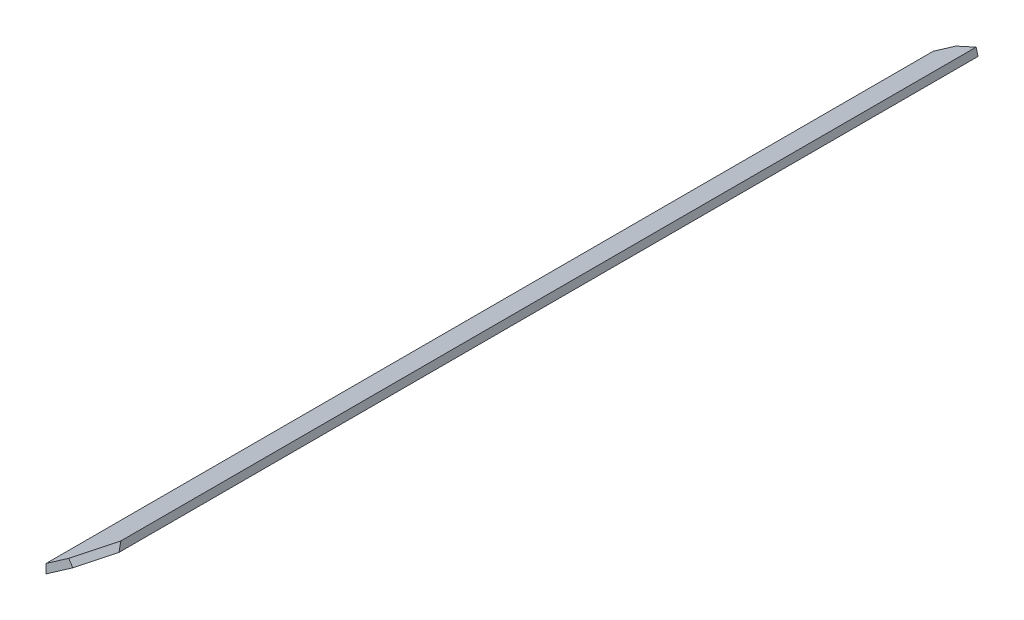
ISO-10303-21;
HEADER;
FILE_DESCRIPTION(('STEP AP214'),'2;1');
FILE_NAME('part.step','',(''),(''),'','','');
FILE_SCHEMA(('AUTOMOTIVE_DESIGN { 1 0 10303 214 1 1 1 1 }'));
ENDSEC;
DATA;
#1=APPLICATION_CONTEXT('core data for automotive mechanical design processes');
#2=APPLICATION_PROTOCOL_DEFINITION('international standard','automotive_design',2000,#1);
#3=PRODUCT_CONTEXT('',#1,'mechanical');
#4=PRODUCT('Part','Part','',(#3));
#5=PRODUCT_RELATED_PRODUCT_CATEGORY('part','',(#4));
#6=PRODUCT_DEFINITION_FORMATION('','',#4);
#7=PRODUCT_DEFINITION_CONTEXT('part definition',#1,'design');
#8=PRODUCT_DEFINITION('design','',#6,#7);
#9=PRODUCT_DEFINITION_SHAPE('','',#8);
#10=(LENGTH_UNIT() NAMED_UNIT(*) SI_UNIT(.MILLI.,.METRE.));
#11=(NAMED_UNIT(*) PLANE_ANGLE_UNIT() SI_UNIT($,.RADIAN.));
#12=(NAMED_UNIT(*) SI_UNIT($,.STERADIAN.) SOLID_ANGLE_UNIT());
#13=UNCERTAINTY_MEASURE_WITH_UNIT(LENGTH_MEASURE(1.E-05),#10,'distance_accuracy_value','');
#14=(GEOMETRIC_REPRESENTATION_CONTEXT(3) GLOBAL_UNCERTAINTY_ASSIGNED_CONTEXT((#13)) GLOBAL_UNIT_ASSIGNED_CONTEXT((#10,
#11,#12)) REPRESENTATION_CONTEXT('',''));
#15=CARTESIAN_POINT('',(0.,0.,0.));
#16=DIRECTION('',(0.,0.,1.));
#17=DIRECTION('',(1.,0.,0.));
#18=AXIS2_PLACEMENT_3D('',#15,#16,#17);
#19=CARTESIAN_POINT('',(3.99999999999999,-95.4746152702227,21.));
#20=DIRECTION('',(-1.,0.,0.));
#21=DIRECTION('',(0.,0.,1.));
#22=AXIS2_PLACEMENT_3D('',#19,#20,#21);
#23=PLANE('',#22);
#24=DIRECTION('',(0.,0.,-1.));
#25=VECTOR('',#24,1.);
#26=CARTESIAN_POINT('',(3.99999999999999,-94.4746152702227,21.));
#27=LINE('',#26,#25);
#28=CARTESIAN_POINT('',(4.00000000000001,-94.4746152702228,19.2313574149905));
#29=VERTEX_POINT('',#28);
#30=CARTESIAN_POINT('',(4.00000000000002,-94.4746152702228,-75.2313574149905));
#31=VERTEX_POINT('',#30);
#32=EDGE_CURVE('E11',#29,#31,#27,.T.);
#33=ORIENTED_EDGE('',*,*,#32,.F.);
#34=DIRECTION('',(0.,-0.979174483438038,0.203020518627679));
#35=VECTOR('',#34,1.);
#36=CARTESIAN_POINT('',(3.99999999999999,-95.7849908405784,19.5030486532636));
#37=LINE('',#36,#35);
#38=CARTESIAN_POINT('',(3.99999999999999,-95.4746152702227,19.4386958639203));
#39=VERTEX_POINT('',#38);
#40=EDGE_CURVE('E128',#29,#39,#37,.T.);
#41=ORIENTED_EDGE('',*,*,#40,.T.);
#42=DIRECTION('',(0.,0.,-1.));
#43=VECTOR('',#42,1.);
#44=CARTESIAN_POINT('',(3.99999999999999,-95.4746152702227,21.));
#45=LINE('',#44,#43);
#46=CARTESIAN_POINT('',(4.,-95.4746152702227,-75.4386958639203));
#47=VERTEX_POINT('',#46);
#48=EDGE_CURVE('E98',#39,#47,#45,.T.);
#49=ORIENTED_EDGE('',*,*,#48,.T.);
#50=DIRECTION('',(0.,0.979174483438038,0.203020518627679));
#51=VECTOR('',#50,1.);
#52=CARTESIAN_POINT('',(3.99999999999999,-76.3033247180296,-71.4637502168461));
#53=LINE('',#52,#51);
#54=EDGE_CURVE('E90',#47,#31,#53,.T.);
#55=ORIENTED_EDGE('',*,*,#54,.T.);
#56=EDGE_LOOP('',(#33,#41,#49,#55));
#57=FACE_BOUND('',#56,.T.);
#58=ADVANCED_FACE('F33',(#57),#23,.F.);
#59=CARTESIAN_POINT('',(3.99999999999999,-94.4746152702227,21.));
#60=DIRECTION('',(0.571374632151441,-0.820689362508011,0.));
#61=DIRECTION('',(0.820689362508011,0.571374632151441,0.));
#62=AXIS2_PLACEMENT_3D('',#59,#60,#61);
#63=PLANE('',#62);
#64=DIRECTION('',(-0.820689362508011,-0.571374632151441,0.));
#65=VECTOR('',#64,1.);
#66=CARTESIAN_POINT('',(3.99999999999999,-94.4746152702227,21.));
#67=LINE('',#66,#65);
#68=CARTESIAN_POINT('',(0.,-97.2594674116241,21.));
#69=VERTEX_POINT('',#68);
#70=CARTESIAN_POINT('',(-2.50000000000006,-99.,21.));
#71=VERTEX_POINT('',#70);
#72=EDGE_CURVE('E107',#69,#71,#67,.T.);
#73=ORIENTED_EDGE('',*,*,#72,.F.);
#74=DIRECTION('',(-0.771466553840044,-0.537105071120245,0.341112150008004));
#75=VECTOR('',#74,1.);
#76=CARTESIAN_POINT('',(4.00000000000001,-94.4746152702228,19.2313574149905));
#77=LINE('',#76,#75);
#78=EDGE_CURVE('E47',#29,#69,#77,.T.);
#79=ORIENTED_EDGE('',*,*,#78,.F.);
#80=ORIENTED_EDGE('',*,*,#32,.T.);
#81=DIRECTION('',(0.771466553840043,0.537105071120247,0.341112150008003));
#82=VECTOR('',#81,1.);
#83=CARTESIAN_POINT('',(4.00000000000002,-94.4746152702228,-75.2313574149905));
#84=LINE('',#83,#82);
#85=CARTESIAN_POINT('',(0.,-97.2594674116241,-77.));
#86=VERTEX_POINT('',#85);
#87=EDGE_CURVE('E141',#86,#31,#84,.T.);
#88=ORIENTED_EDGE('',*,*,#87,.F.);
#89=DIRECTION('',(-0.820689362508011,-0.571374632151441,0.));
#90=VECTOR('',#89,1.);
#91=CARTESIAN_POINT('',(3.99999999999999,-94.4746152702227,-77.));
#92=LINE('',#91,#90);
#93=CARTESIAN_POINT('',(-2.50000000000006,-99.,-77.));
#94=VERTEX_POINT('',#93);
#95=EDGE_CURVE('E123',#86,#94,#92,.T.);
#96=ORIENTED_EDGE('',*,*,#95,.T.);
#97=DIRECTION('',(0.,0.,-1.));
#98=VECTOR('',#97,1.);
#99=CARTESIAN_POINT('',(-2.50000000000006,-99.,21.));
#100=LINE('',#99,#98);
#101=EDGE_CURVE('E40',#71,#94,#100,.T.);
#102=ORIENTED_EDGE('',*,*,#101,.F.);
#103=EDGE_LOOP('',(#73,#79,#80,#88,#96,#102));
#104=FACE_BOUND('',#103,.T.);
#105=ADVANCED_FACE('F131',(#104),#63,.F.);
#106=CARTESIAN_POINT('',(-2.50000000000006,-100.,21.));
#107=DIRECTION('',(1.,0.,0.));
#108=DIRECTION('',(0.,1.,0.));
#109=AXIS2_PLACEMENT_3D('',#106,#107,#108);
#110=PLANE('',#109);
#111=ORIENTED_EDGE('',*,*,#101,.T.);
#112=DIRECTION('',(0.,-1.,0.));
#113=VECTOR('',#112,1.);
#114=CARTESIAN_POINT('',(-2.50000000000006,-100.,-77.));
#115=LINE('',#114,#113);
#116=CARTESIAN_POINT('',(-2.50000000000006,-100.,-77.));
#117=VERTEX_POINT('',#116);
#118=EDGE_CURVE('E117',#94,#117,#115,.T.);
#119=ORIENTED_EDGE('',*,*,#118,.T.);
#120=DIRECTION('',(0.,0.,-1.));
#121=VECTOR('',#120,1.);
#122=CARTESIAN_POINT('',(-2.50000000000006,-100.,21.));
#123=LINE('',#122,#121);
#124=CARTESIAN_POINT('',(-2.50000000000006,-100.,21.));
#125=VERTEX_POINT('',#124);
#126=EDGE_CURVE('E105',#125,#117,#123,.T.);
#127=ORIENTED_EDGE('',*,*,#126,.F.);
#128=DIRECTION('',(0.,-1.,0.));
#129=VECTOR('',#128,1.);
#130=CARTESIAN_POINT('',(-2.50000000000006,-100.,21.));
#131=LINE('',#130,#129);
#132=EDGE_CURVE('E102',#71,#125,#131,.T.);
#133=ORIENTED_EDGE('',*,*,#132,.F.);
#134=EDGE_LOOP('',(#111,#119,#127,#133));
#135=FACE_BOUND('',#134,.T.);
#136=ADVANCED_FACE('F116',(#135),#110,.F.);
#137=CARTESIAN_POINT('',(3.99999999999999,-95.4746152702227,21.));
#138=DIRECTION('',(-0.571374632151441,0.820689362508011,0.));
#139=DIRECTION('',(-0.820689362508011,-0.571374632151441,0.));
#140=AXIS2_PLACEMENT_3D('',#137,#138,#139);
#141=PLANE('',#140);
#142=ORIENTED_EDGE('',*,*,#48,.F.);
#143=DIRECTION('',(-0.771466553840044,-0.537105071120245,0.341112150008004));
#144=VECTOR('',#143,1.);
#145=CARTESIAN_POINT('',(4.4689210826136,-95.1481462999566,19.2313574149905));
#146=LINE('',#145,#144);
#147=CARTESIAN_POINT('',(0.468921082613608,-97.9329984413579,21.));
#148=VERTEX_POINT('',#147);
#149=EDGE_CURVE('E85',#39,#148,#146,.T.);
#150=ORIENTED_EDGE('',*,*,#149,.T.);
#151=DIRECTION('',(0.820689362508011,0.571374632151441,0.));
#152=VECTOR('',#151,1.);
#153=CARTESIAN_POINT('',(3.99999999999999,-95.4746152702227,21.));
#154=LINE('',#153,#152);
#155=EDGE_CURVE('E96',#125,#148,#154,.T.);
#156=ORIENTED_EDGE('',*,*,#155,.F.);
#157=ORIENTED_EDGE('',*,*,#126,.T.);
#158=DIRECTION('',(0.820689362508011,0.571374632151441,0.));
#159=VECTOR('',#158,1.);
#160=CARTESIAN_POINT('',(3.99999999999999,-95.4746152702227,-77.));
#161=LINE('',#160,#159);
#162=CARTESIAN_POINT('',(0.468921082613592,-97.9329984413579,-77.));
#163=VERTEX_POINT('',#162);
#164=EDGE_CURVE('E125',#117,#163,#161,.T.);
#165=ORIENTED_EDGE('',*,*,#164,.T.);
#166=DIRECTION('',(0.771466553840043,0.537105071120247,0.341112150008003));
#167=VECTOR('',#166,1.);
#168=CARTESIAN_POINT('',(4.46892108261361,-95.1481462999565,-75.2313574149905));
#169=LINE('',#168,#167);
#170=EDGE_CURVE('E55',#163,#47,#169,.T.);
#171=ORIENTED_EDGE('',*,*,#170,.T.);
#172=EDGE_LOOP('',(#142,#150,#156,#157,#165,#171));
#173=FACE_BOUND('',#172,.T.);
#174=ADVANCED_FACE('F95',(#173),#141,.F.);
#175=CARTESIAN_POINT('',(0.,0.,21.));
#176=DIRECTION('',(0.,0.,1.));
#177=DIRECTION('',(1.,0.,0.));
#178=AXIS2_PLACEMENT_3D('',#175,#176,#177);
#179=PLANE('',#178);
#180=DIRECTION('',(-0.571374632151441,0.820689362508011,0.));
#181=VECTOR('',#180,1.);
#182=CARTESIAN_POINT('',(0.468921082613608,-97.9329984413579,21.));
#183=LINE('',#182,#181);
#184=EDGE_CURVE('E82',#148,#69,#183,.T.);
#185=ORIENTED_EDGE('',*,*,#184,.T.);
#186=ORIENTED_EDGE('',*,*,#72,.T.);
#187=ORIENTED_EDGE('',*,*,#132,.T.);
#188=ORIENTED_EDGE('',*,*,#155,.T.);
#189=EDGE_LOOP('',(#185,#186,#187,#188));
#190=FACE_BOUND('',#189,.T.);
#191=ADVANCED_FACE('F100',(#190),#179,.T.);
#192=CARTESIAN_POINT('',(0.,0.,-77.));
#193=DIRECTION('',(0.,0.,1.));
#194=DIRECTION('',(1.,0.,0.));
#195=AXIS2_PLACEMENT_3D('',#192,#193,#194);
#196=PLANE('',#195);
#197=ORIENTED_EDGE('',*,*,#95,.F.);
#198=DIRECTION('',(-0.571374632151441,0.820689362508011,0.));
#199=VECTOR('',#198,1.);
#200=CARTESIAN_POINT('',(0.468921082613608,-97.9329984413579,-77.));
#201=LINE('',#200,#199);
#202=EDGE_CURVE('E134',#163,#86,#201,.T.);
#203=ORIENTED_EDGE('',*,*,#202,.F.);
#204=ORIENTED_EDGE('',*,*,#164,.F.);
#205=ORIENTED_EDGE('',*,*,#118,.F.);
#206=EDGE_LOOP('',(#197,#203,#204,#205));
#207=FACE_BOUND('',#206,.T.);
#208=ADVANCED_FACE('F122',(#207),#196,.F.);
#209=CARTESIAN_POINT('',(4.46892108261361,-95.1481462999565,-75.2313574149905));
#210=DIRECTION('',(-0.279947112933805,-0.19490282923321,0.940022606705242));
#211=DIRECTION('',(0.958402313002179,0.,0.285420753331065));
#212=AXIS2_PLACEMENT_3D('',#209,#210,#211);
#213=PLANE('',#212);
#214=ORIENTED_EDGE('',*,*,#170,.F.);
#215=ORIENTED_EDGE('',*,*,#202,.T.);
#216=ORIENTED_EDGE('',*,*,#87,.T.);
#217=ORIENTED_EDGE('',*,*,#54,.F.);
#218=EDGE_LOOP('',(#214,#215,#216,#217));
#219=FACE_BOUND('',#218,.T.);
#220=ADVANCED_FACE('F143',(#219),#213,.F.);
#221=CARTESIAN_POINT('',(4.4689210826136,-95.1481462999566,19.2313574149905));
#222=DIRECTION('',(-0.279947112933806,-0.194902829233211,-0.940022606705241));
#223=DIRECTION('',(-0.958402313002179,0.,0.285420753331065));
#224=AXIS2_PLACEMENT_3D('',#221,#222,#223);
#225=PLANE('',#224);
#226=ORIENTED_EDGE('',*,*,#78,.T.);
#227=ORIENTED_EDGE('',*,*,#184,.F.);
#228=ORIENTED_EDGE('',*,*,#149,.F.);
#229=ORIENTED_EDGE('',*,*,#40,.F.);
#230=EDGE_LOOP('',(#226,#227,#228,#229));
#231=FACE_BOUND('',#230,.T.);
#232=ADVANCED_FACE('F84',(#231),#225,.F.);
#233=CLOSED_SHELL('',(#58,#105,#136,#174,#191,#208,#220,#232));
#234=MANIFOLD_SOLID_BREP('B2',#233);
#235=ADVANCED_BREP_SHAPE_REPRESENTATION('',(#18,#234),#14);
#236=SHAPE_DEFINITION_REPRESENTATION(#9,#235);
ENDSEC;
END-ISO-10303-21;
